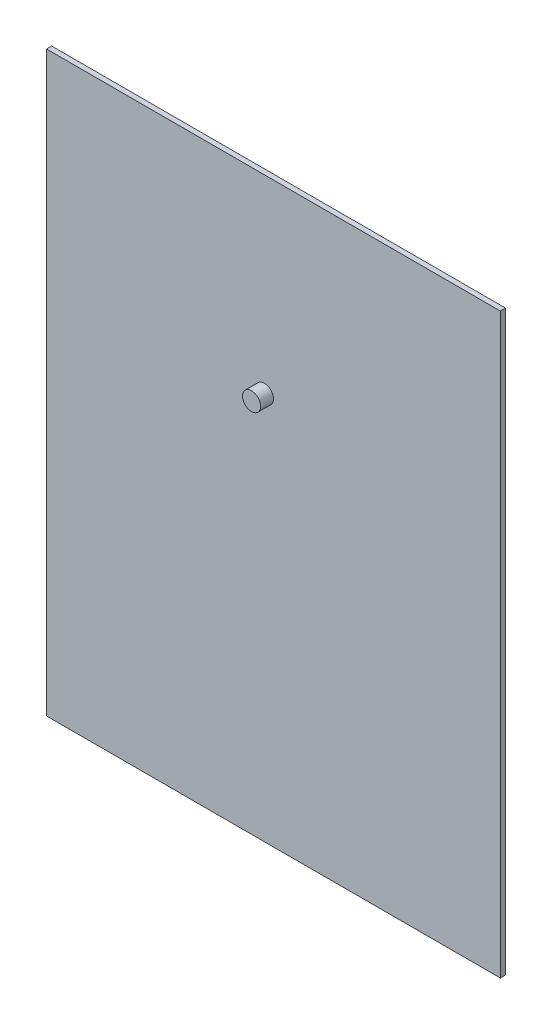
ISO-10303-21;
HEADER;
FILE_DESCRIPTION(('STEP AP214'),'2;1');
FILE_NAME('part.step','',(''),(''),'','','');
FILE_SCHEMA(('AUTOMOTIVE_DESIGN { 1 0 10303 214 1 1 1 1 }'));
ENDSEC;
DATA;
#1=APPLICATION_CONTEXT('core data for automotive mechanical design processes');
#2=APPLICATION_PROTOCOL_DEFINITION('international standard','automotive_design',2000,#1);
#3=PRODUCT_CONTEXT('',#1,'mechanical');
#4=PRODUCT('Part','Part','',(#3));
#5=PRODUCT_RELATED_PRODUCT_CATEGORY('part','',(#4));
#6=PRODUCT_DEFINITION_FORMATION('','',#4);
#7=PRODUCT_DEFINITION_CONTEXT('part definition',#1,'design');
#8=PRODUCT_DEFINITION('design','',#6,#7);
#9=PRODUCT_DEFINITION_SHAPE('','',#8);
#10=(LENGTH_UNIT() NAMED_UNIT(*) SI_UNIT(.MILLI.,.METRE.));
#11=(NAMED_UNIT(*) PLANE_ANGLE_UNIT() SI_UNIT($,.RADIAN.));
#12=(NAMED_UNIT(*) SI_UNIT($,.STERADIAN.) SOLID_ANGLE_UNIT());
#13=UNCERTAINTY_MEASURE_WITH_UNIT(LENGTH_MEASURE(1.E-05),#10,'distance_accuracy_value','');
#14=(GEOMETRIC_REPRESENTATION_CONTEXT(3) GLOBAL_UNCERTAINTY_ASSIGNED_CONTEXT((#13)) GLOBAL_UNIT_ASSIGNED_CONTEXT((#10,
#11,#12)) REPRESENTATION_CONTEXT('',''));
#15=CARTESIAN_POINT('',(0.,0.,0.));
#16=DIRECTION('',(0.,0.,1.));
#17=DIRECTION('',(1.,0.,0.));
#18=AXIS2_PLACEMENT_3D('',#15,#16,#17);
#19=CARTESIAN_POINT('',(-45.8487121572944,-188.56259806223,2.));
#20=DIRECTION('',(1.,0.,0.));
#21=DIRECTION('',(0.,0.,-1.));
#22=AXIS2_PLACEMENT_3D('',#19,#20,#21);
#23=PLANE('',#22);
#24=DIRECTION('',(0.,-1.,0.));
#25=VECTOR('',#24,1.);
#26=CARTESIAN_POINT('',(-45.8487121572944,-188.56259806223,0.));
#27=LINE('',#26,#25);
#28=CARTESIAN_POINT('',(-45.8487121572944,35.4374019377701,0.));
#29=VERTEX_POINT('',#28);
#30=CARTESIAN_POINT('',(-45.8487121572944,-188.56259806223,0.));
#31=VERTEX_POINT('',#30);
#32=EDGE_CURVE('E101',#29,#31,#27,.T.);
#33=ORIENTED_EDGE('',*,*,#32,.T.);
#34=DIRECTION('',(0.,0.,-1.));
#35=VECTOR('',#34,1.);
#36=CARTESIAN_POINT('',(-45.8487121572944,-188.56259806223,2.));
#37=LINE('',#36,#35);
#38=CARTESIAN_POINT('',(-45.8487121572944,-188.56259806223,2.));
#39=VERTEX_POINT('',#38);
#40=EDGE_CURVE('E43',#39,#31,#37,.T.);
#41=ORIENTED_EDGE('',*,*,#40,.F.);
#42=DIRECTION('',(0.,-1.,0.));
#43=VECTOR('',#42,1.);
#44=CARTESIAN_POINT('',(-45.8487121572944,-188.56259806223,2.));
#45=LINE('',#44,#43);
#46=CARTESIAN_POINT('',(-45.8487121572944,35.4374019377701,2.));
#47=VERTEX_POINT('',#46);
#48=EDGE_CURVE('E87',#47,#39,#45,.T.);
#49=ORIENTED_EDGE('',*,*,#48,.F.);
#50=DIRECTION('',(0.,0.,-1.));
#51=VECTOR('',#50,1.);
#52=CARTESIAN_POINT('',(-45.8487121572944,35.4374019377701,2.));
#53=LINE('',#52,#51);
#54=EDGE_CURVE('E97',#47,#29,#53,.T.);
#55=ORIENTED_EDGE('',*,*,#54,.T.);
#56=EDGE_LOOP('',(#33,#41,#49,#55));
#57=FACE_BOUND('',#56,.T.);
#58=ADVANCED_FACE('F35',(#57),#23,.F.);
#59=CARTESIAN_POINT('',(130.151287842706,-188.56259806223,2.));
#60=DIRECTION('',(0.,1.,0.));
#61=DIRECTION('',(0.,0.,1.));
#62=AXIS2_PLACEMENT_3D('',#59,#60,#61);
#63=PLANE('',#62);
#64=DIRECTION('',(1.,0.,0.));
#65=VECTOR('',#64,1.);
#66=CARTESIAN_POINT('',(130.151287842706,-188.56259806223,0.));
#67=LINE('',#66,#65);
#68=CARTESIAN_POINT('',(130.151287842706,-188.56259806223,0.));
#69=VERTEX_POINT('',#68);
#70=EDGE_CURVE('E92',#31,#69,#67,.T.);
#71=ORIENTED_EDGE('',*,*,#70,.T.);
#72=DIRECTION('',(0.,0.,-1.));
#73=VECTOR('',#72,1.);
#74=CARTESIAN_POINT('',(130.151287842706,-188.56259806223,2.));
#75=LINE('',#74,#73);
#76=CARTESIAN_POINT('',(130.151287842706,-188.56259806223,2.));
#77=VERTEX_POINT('',#76);
#78=EDGE_CURVE('E90',#77,#69,#75,.T.);
#79=ORIENTED_EDGE('',*,*,#78,.F.);
#80=DIRECTION('',(1.,0.,0.));
#81=VECTOR('',#80,1.);
#82=CARTESIAN_POINT('',(130.151287842706,-188.56259806223,2.));
#83=LINE('',#82,#81);
#84=EDGE_CURVE('E82',#39,#77,#83,.T.);
#85=ORIENTED_EDGE('',*,*,#84,.F.);
#86=ORIENTED_EDGE('',*,*,#40,.T.);
#87=EDGE_LOOP('',(#71,#79,#85,#86));
#88=FACE_BOUND('',#87,.T.);
#89=ADVANCED_FACE('F91',(#88),#63,.F.);
#90=CARTESIAN_POINT('',(130.151287842706,35.4374019377701,2.));
#91=DIRECTION('',(-1.,0.,0.));
#92=DIRECTION('',(0.,0.,1.));
#93=AXIS2_PLACEMENT_3D('',#90,#91,#92);
#94=PLANE('',#93);
#95=DIRECTION('',(0.,1.,0.));
#96=VECTOR('',#95,1.);
#97=CARTESIAN_POINT('',(130.151287842706,35.4374019377701,0.));
#98=LINE('',#97,#96);
#99=CARTESIAN_POINT('',(130.151287842706,35.4374019377701,0.));
#100=VERTEX_POINT('',#99);
#101=EDGE_CURVE('E68',#69,#100,#98,.T.);
#102=ORIENTED_EDGE('',*,*,#101,.T.);
#103=DIRECTION('',(0.,0.,-1.));
#104=VECTOR('',#103,1.);
#105=CARTESIAN_POINT('',(130.151287842706,35.4374019377701,2.));
#106=LINE('',#105,#104);
#107=CARTESIAN_POINT('',(130.151287842706,35.4374019377701,2.));
#108=VERTEX_POINT('',#107);
#109=EDGE_CURVE('E93',#108,#100,#106,.T.);
#110=ORIENTED_EDGE('',*,*,#109,.F.);
#111=DIRECTION('',(0.,1.,0.));
#112=VECTOR('',#111,1.);
#113=CARTESIAN_POINT('',(130.151287842706,35.4374019377701,2.));
#114=LINE('',#113,#112);
#115=EDGE_CURVE('E85',#77,#108,#114,.T.);
#116=ORIENTED_EDGE('',*,*,#115,.F.);
#117=ORIENTED_EDGE('',*,*,#78,.T.);
#118=EDGE_LOOP('',(#102,#110,#116,#117));
#119=FACE_BOUND('',#118,.T.);
#120=ADVANCED_FACE('F95',(#119),#94,.F.);
#121=CARTESIAN_POINT('',(-45.8487121572944,35.4374019377701,2.));
#122=DIRECTION('',(0.,-1.,0.));
#123=DIRECTION('',(0.,0.,-1.));
#124=AXIS2_PLACEMENT_3D('',#121,#122,#123);
#125=PLANE('',#124);
#126=DIRECTION('',(-1.,0.,0.));
#127=VECTOR('',#126,1.);
#128=CARTESIAN_POINT('',(-45.8487121572944,35.4374019377701,0.));
#129=LINE('',#128,#127);
#130=EDGE_CURVE('E74',#100,#29,#129,.T.);
#131=ORIENTED_EDGE('',*,*,#130,.T.);
#132=ORIENTED_EDGE('',*,*,#54,.F.);
#133=DIRECTION('',(-1.,0.,0.));
#134=VECTOR('',#133,1.);
#135=CARTESIAN_POINT('',(-45.8487121572944,35.4374019377701,2.));
#136=LINE('',#135,#134);
#137=EDGE_CURVE('E51',#108,#47,#136,.T.);
#138=ORIENTED_EDGE('',*,*,#137,.F.);
#139=ORIENTED_EDGE('',*,*,#109,.T.);
#140=EDGE_LOOP('',(#131,#132,#138,#139));
#141=FACE_BOUND('',#140,.T.);
#142=ADVANCED_FACE('F124',(#141),#125,.F.);
#143=CARTESIAN_POINT('',(0.,0.,2.));
#144=DIRECTION('',(0.,0.,-1.));
#145=DIRECTION('',(-1.,0.,0.));
#146=AXIS2_PLACEMENT_3D('',#143,#144,#145);
#147=PLANE('',#146);
#148=CARTESIAN_POINT('',(38.6653381017821,-38.0719030061998,2.));
#149=DIRECTION('',(0.,0.,-1.));
#150=DIRECTION('',(-1.,0.,0.));
#151=AXIS2_PLACEMENT_3D('',#148,#149,#150);
#152=CIRCLE('',#151,3.50000000000001);
#153=CARTESIAN_POINT('',(35.1653381017821,-38.0719030061998,2.));
#154=VERTEX_POINT('',#153);
#155=EDGE_CURVE('E11',#154,#154,#152,.F.);
#156=ORIENTED_EDGE('',*,*,#155,.F.);
#157=EDGE_LOOP('',(#156));
#158=FACE_BOUND('',#157,.T.);
#159=ORIENTED_EDGE('',*,*,#48,.T.);
#160=ORIENTED_EDGE('',*,*,#84,.T.);
#161=ORIENTED_EDGE('',*,*,#115,.T.);
#162=ORIENTED_EDGE('',*,*,#137,.T.);
#163=EDGE_LOOP('',(#159,#160,#161,#162));
#164=FACE_BOUND('',#163,.T.);
#165=ADVANCED_FACE('F83',(#158,#164),#147,.F.);
#166=CARTESIAN_POINT('',(0.,0.,0.));
#167=DIRECTION('',(0.,0.,-1.));
#168=DIRECTION('',(-1.,0.,0.));
#169=AXIS2_PLACEMENT_3D('',#166,#167,#168);
#170=PLANE('',#169);
#171=ORIENTED_EDGE('',*,*,#32,.F.);
#172=ORIENTED_EDGE('',*,*,#130,.F.);
#173=ORIENTED_EDGE('',*,*,#101,.F.);
#174=ORIENTED_EDGE('',*,*,#70,.F.);
#175=EDGE_LOOP('',(#171,#172,#173,#174));
#176=FACE_BOUND('',#175,.T.);
#177=ADVANCED_FACE('F112',(#176),#170,.T.);
#178=CARTESIAN_POINT('',(38.6653381017821,-38.0719030061998,7.));
#179=DIRECTION('',(0.,0.,-1.));
#180=DIRECTION('',(-1.,0.,0.));
#181=AXIS2_PLACEMENT_3D('',#178,#179,#180);
#182=CYLINDRICAL_SURFACE('',#181,3.50000000000001);
#183=CARTESIAN_POINT('',(38.6653381017821,-38.0719030061998,7.));
#184=DIRECTION('',(0.,0.,1.));
#185=DIRECTION('',(1.,0.,0.));
#186=AXIS2_PLACEMENT_3D('',#183,#184,#185);
#187=CIRCLE('',#186,3.50000000000001);
#188=CARTESIAN_POINT('',(42.1653381017821,-38.0719030061998,7.));
#189=VERTEX_POINT('',#188);
#190=EDGE_CURVE('E104',#189,#189,#187,.T.);
#191=ORIENTED_EDGE('',*,*,#190,.F.);
#192=EDGE_LOOP('',(#191));
#193=FACE_BOUND('',#192,.T.);
#194=ORIENTED_EDGE('',*,*,#155,.T.);
#195=EDGE_LOOP('',(#194));
#196=FACE_BOUND('',#195,.T.);
#197=ADVANCED_FACE('F114',(#193,#196),#182,.T.);
#198=CARTESIAN_POINT('',(38.6653381017821,-38.0719030061998,7.));
#199=DIRECTION('',(0.,0.,1.));
#200=DIRECTION('',(1.,0.,0.));
#201=AXIS2_PLACEMENT_3D('',#198,#199,#200);
#202=PLANE('',#201);
#203=ORIENTED_EDGE('',*,*,#190,.T.);
#204=EDGE_LOOP('',(#203));
#205=FACE_BOUND('',#204,.T.);
#206=ADVANCED_FACE('F120',(#205),#202,.T.);
#207=CLOSED_SHELL('',(#58,#89,#120,#142,#165,#177,#197,#206));
#208=MANIFOLD_SOLID_BREP('B2',#207);
#209=ADVANCED_BREP_SHAPE_REPRESENTATION('',(#18,#208),#14);
#210=SHAPE_DEFINITION_REPRESENTATION(#9,#209);
ENDSEC;
END-ISO-10303-21;
